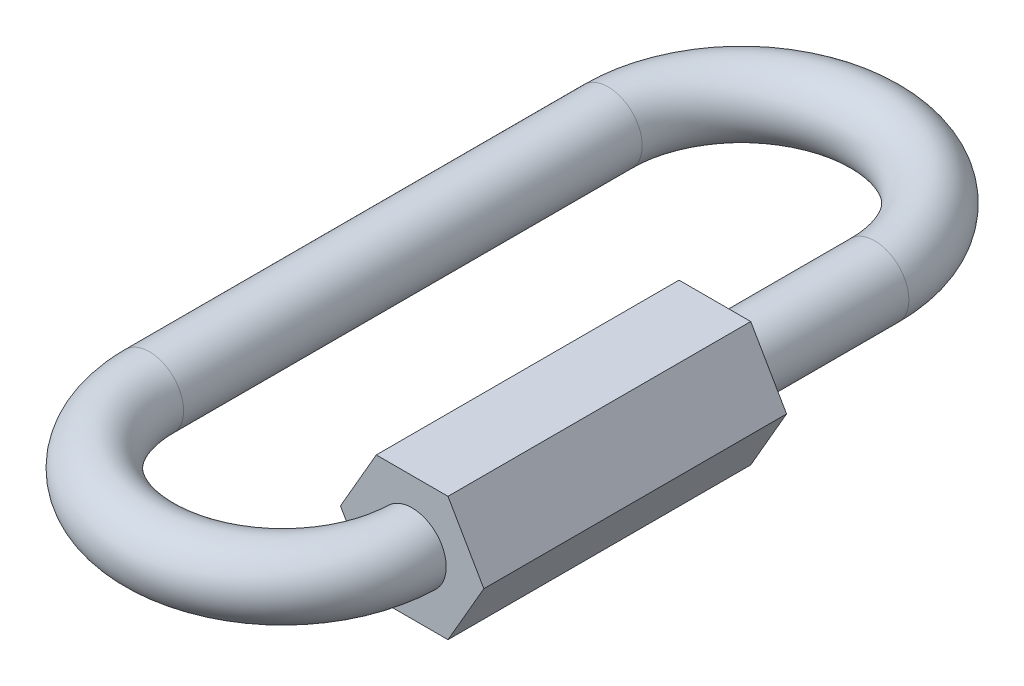
ISO-10303-21;
HEADER;
FILE_DESCRIPTION(('STEP AP214'),'2;1');
FILE_NAME('part.step','',(''),(''),'','','');
FILE_SCHEMA(('AUTOMOTIVE_DESIGN { 1 0 10303 214 1 1 1 1 }'));
ENDSEC;
DATA;
#1=APPLICATION_CONTEXT('core data for automotive mechanical design processes');
#2=APPLICATION_PROTOCOL_DEFINITION('international standard','automotive_design',2000,#1);
#3=PRODUCT_CONTEXT('',#1,'mechanical');
#4=PRODUCT('Part','Part','',(#3));
#5=PRODUCT_RELATED_PRODUCT_CATEGORY('part','',(#4));
#6=PRODUCT_DEFINITION_FORMATION('','',#4);
#7=PRODUCT_DEFINITION_CONTEXT('part definition',#1,'design');
#8=PRODUCT_DEFINITION('design','',#6,#7);
#9=PRODUCT_DEFINITION_SHAPE('','',#8);
#10=(LENGTH_UNIT() NAMED_UNIT(*) SI_UNIT(.MILLI.,.METRE.));
#11=(NAMED_UNIT(*) PLANE_ANGLE_UNIT() SI_UNIT($,.RADIAN.));
#12=(NAMED_UNIT(*) SI_UNIT($,.STERADIAN.) SOLID_ANGLE_UNIT());
#13=UNCERTAINTY_MEASURE_WITH_UNIT(LENGTH_MEASURE(1.E-05),#10,'distance_accuracy_value','');
#14=(GEOMETRIC_REPRESENTATION_CONTEXT(3) GLOBAL_UNCERTAINTY_ASSIGNED_CONTEXT((#13)) GLOBAL_UNIT_ASSIGNED_CONTEXT((#10,
#11,#12)) REPRESENTATION_CONTEXT('',''));
#15=CARTESIAN_POINT('',(0.,0.,0.));
#16=DIRECTION('',(0.,0.,1.));
#17=DIRECTION('',(1.,0.,0.));
#18=AXIS2_PLACEMENT_3D('',#15,#16,#17);
#19=CARTESIAN_POINT('',(8.5344,0.,-29.3624));
#20=DIRECTION('',(0.,0.,1.));
#21=DIRECTION('',(1.,0.,0.));
#22=AXIS2_PLACEMENT_3D('',#19,#20,#21);
#23=CYLINDRICAL_SURFACE('',#22,2.1844);
#24=CARTESIAN_POINT('',(8.5344,0.,-29.3624));
#25=DIRECTION('',(0.,0.,1.));
#26=DIRECTION('',(1.,0.,0.));
#27=AXIS2_PLACEMENT_3D('',#24,#25,#26);
#28=CIRCLE('',#27,2.1844);
#29=CARTESIAN_POINT('',(10.7188,0.,-29.3624));
#30=VERTEX_POINT('',#29);
#31=EDGE_CURVE('E48',#30,#30,#28,.T.);
#32=ORIENTED_EDGE('',*,*,#31,.T.);
#33=EDGE_LOOP('',(#32));
#34=FACE_BOUND('',#33,.T.);
#35=CARTESIAN_POINT('',(8.5344,0.,-19.1262));
#36=DIRECTION('',(0.,0.,1.));
#37=DIRECTION('',(1.,0.,0.));
#38=AXIS2_PLACEMENT_3D('',#35,#36,#37);
#39=CIRCLE('',#38,2.1844);
#40=CARTESIAN_POINT('',(10.7188,0.,-19.1262));
#41=VERTEX_POINT('',#40);
#42=EDGE_CURVE('E42',#41,#41,#39,.F.);
#43=ORIENTED_EDGE('',*,*,#42,.T.);
#44=EDGE_LOOP('',(#43));
#45=FACE_BOUND('',#44,.T.);
#46=ADVANCED_FACE('F39',(#34,#45),#23,.T.);
#47=CARTESIAN_POINT('',(0.,0.,-29.3624));
#48=DIRECTION('',(0.,-1.,0.));
#49=DIRECTION('',(0.,0.,-1.));
#50=AXIS2_PLACEMENT_3D('',#47,#48,#49);
#51=TOROIDAL_SURFACE('',#50,8.5344,2.1844);
#52=CARTESIAN_POINT('',(-8.5344,0.,-29.3624));
#53=DIRECTION('',(0.,0.,-1.));
#54=DIRECTION('',(-1.,0.,0.));
#55=AXIS2_PLACEMENT_3D('',#52,#53,#54);
#56=CIRCLE('',#55,2.1844);
#57=CARTESIAN_POINT('',(-10.7188,0.,-29.3624));
#58=VERTEX_POINT('',#57);
#59=EDGE_CURVE('E166',#58,#58,#56,.T.);
#60=CARTESIAN_POINT('',(0.,0.,-29.3624));
#61=DIRECTION('',(0.,-1.,0.));
#62=DIRECTION('',(0.,0.,-1.));
#63=AXIS2_PLACEMENT_3D('',#60,#61,#62);
#64=CIRCLE('',#63,10.7188);
#65=EDGE_CURVE('',#58,#30,#64,.T.);
#66=ORIENTED_EDGE('',*,*,#59,.T.);
#67=ORIENTED_EDGE('',*,*,#31,.F.);
#68=ORIENTED_EDGE('',*,*,#65,.T.);
#69=ORIENTED_EDGE('',*,*,#65,.F.);
#70=EDGE_LOOP('',(#66,#68,#67,#69));
#71=FACE_BOUND('',#70,.T.);
#72=ADVANCED_FACE('F212',(#71),#51,.T.);
#73=CARTESIAN_POINT('',(-8.5344,0.,0.));
#74=DIRECTION('',(0.,0.,-1.));
#75=DIRECTION('',(-1.,0.,0.));
#76=AXIS2_PLACEMENT_3D('',#73,#74,#75);
#77=CYLINDRICAL_SURFACE('',#76,2.1844);
#78=ORIENTED_EDGE('',*,*,#59,.F.);
#79=EDGE_LOOP('',(#78));
#80=FACE_BOUND('',#79,.T.);
#81=CARTESIAN_POINT('',(-8.5344,0.,0.));
#82=DIRECTION('',(0.,0.,-1.));
#83=DIRECTION('',(-1.,0.,0.));
#84=AXIS2_PLACEMENT_3D('',#81,#82,#83);
#85=CIRCLE('',#84,2.1844);
#86=CARTESIAN_POINT('',(-10.7188,0.,0.));
#87=VERTEX_POINT('',#86);
#88=EDGE_CURVE('E162',#87,#87,#85,.T.);
#89=ORIENTED_EDGE('',*,*,#88,.T.);
#90=EDGE_LOOP('',(#89));
#91=FACE_BOUND('',#90,.T.);
#92=ADVANCED_FACE('F209',(#80,#91),#77,.T.);
#93=CARTESIAN_POINT('',(0.,0.,0.));
#94=DIRECTION('',(0.,-1.,0.));
#95=DIRECTION('',(0.,0.,-1.));
#96=AXIS2_PLACEMENT_3D('',#93,#94,#95);
#97=TOROIDAL_SURFACE('',#96,8.5344,2.1844);
#98=CARTESIAN_POINT('',(6.60273635138359,-1.02913680307873,0.254));
#99=CARTESIAN_POINT('',(6.54493410424649,-0.920986220425956,0.254));
#100=CARTESIAN_POINT('',(6.49621928518624,-0.8078778166678,0.254));
#101=CARTESIAN_POINT('',(6.41843126140718,-0.574993585039513,0.254));
#102=CARTESIAN_POINT('',(6.38938161091199,-0.455209946933372,0.254));
#103=CARTESIAN_POINT('',(6.35182325519836,-0.212509207486216,0.254));
#104=CARTESIAN_POINT('',(6.34330512167944,-0.0895935706096579,0.254));
#105=CARTESIAN_POINT('',(6.34703425020259,0.155888940818484,0.254));
#106=CARTESIAN_POINT('',(6.35927637480292,0.27845589413898,0.254));
#107=CARTESIAN_POINT('',(6.4041615101203,0.519782205060274,0.254));
#108=CARTESIAN_POINT('',(6.43680230087442,0.638541975513966,0.254));
#109=CARTESIAN_POINT('',(6.52155357029986,0.868903204839223,0.254));
#110=CARTESIAN_POINT('',(6.57366483574345,0.980504374229056,0.254));
#111=CARTESIAN_POINT('',(6.69589141090897,1.19341508885029,0.254));
#112=CARTESIAN_POINT('',(6.76601235285301,1.29472140068128,0.254));
#113=CARTESIAN_POINT('',(6.92225564173177,1.48413430211098,0.254));
#114=CARTESIAN_POINT('',(7.00837801633404,1.57224086888596,0.254));
#115=CARTESIAN_POINT('',(7.19424426529594,1.73281866550042,0.254));
#116=CARTESIAN_POINT('',(7.29399761833261,1.80527892397456,0.254));
#117=CARTESIAN_POINT('',(7.50424786085047,1.93243478457657,0.254));
#118=CARTESIAN_POINT('',(7.6147447656595,1.98713036135907,0.254));
#119=CARTESIAN_POINT('',(7.84341217871587,2.07723356789663,0.254));
#120=CARTESIAN_POINT('',(7.96158690739055,2.11263048723407,0.254));
#121=CARTESIAN_POINT('',(8.20220145814708,2.16308572683327,0.254));
#122=CARTESIAN_POINT('',(8.32464129005774,2.17814400022198,0.254));
#123=CARTESIAN_POINT('',(8.57033083216974,2.18749381793182,0.254));
#124=CARTESIAN_POINT('',(8.69358066690469,2.18178209071412,0.254));
#125=CARTESIAN_POINT('',(8.93737129945404,2.14974403353757,0.254));
#126=CARTESIAN_POINT('',(9.05791209998716,2.12341772426786,0.254));
#127=CARTESIAN_POINT('',(9.29283934181651,2.05090139045678,0.254));
#128=CARTESIAN_POINT('',(9.40722688090245,2.00471492243439,0.254));
#129=CARTESIAN_POINT('',(9.62662054959956,1.89378714968666,0.254));
#130=CARTESIAN_POINT('',(9.7316266932342,1.82904587269795,0.254));
#131=CARTESIAN_POINT('',(9.92923875589832,1.6828695467608,0.254));
#132=CARTESIAN_POINT('',(10.0218488508389,1.60144014313072,0.254));
#133=CARTESIAN_POINT('',(10.1920779124684,1.42418441619786,0.254));
#134=CARTESIAN_POINT('',(10.2696969071704,1.3283581197984,0.254));
#135=CARTESIAN_POINT('',(10.4077126432411,1.12506423264063,0.254));
#136=CARTESIAN_POINT('',(10.4681152661837,1.01760063485084,0.254));
#137=CARTESIAN_POINT('',(10.5700163011543,0.794056086987122,0.254));
#138=CARTESIAN_POINT('',(10.6115147404582,0.677975149347002,0.254));
#139=CARTESIAN_POINT('',(10.6744192546228,0.440522789241047,0.254));
#140=CARTESIAN_POINT('',(10.695830416679,0.319152714426058,0.254));
#141=CARTESIAN_POINT('',(10.7179698336219,0.0745406394415559,0.254));
#142=CARTESIAN_POINT('',(10.7186981092979,-0.0487013588462882,0.254));
#143=CARTESIAN_POINT('',(10.699452250969,-0.293543165976258,0.254));
#144=CARTESIAN_POINT('',(10.679480601097,-0.415143170095078,0.254));
#145=CARTESIAN_POINT('',(10.6194064098322,-0.653264455420038,0.254));
#146=CARTESIAN_POINT('',(10.5793038631303,-0.769785735286791,0.254));
#147=CARTESIAN_POINT('',(10.4801061020859,-0.994446056659022,0.254));
#148=CARTESIAN_POINT('',(10.4210103234374,-1.10258484899477,0.254));
#149=CARTESIAN_POINT('',(10.2855056549608,-1.30740836187899,0.254));
#150=CARTESIAN_POINT('',(10.209096772541,-1.40409308732867,0.254));
#151=CARTESIAN_POINT('',(10.0411213576069,-1.5832827960198,0.254));
#152=CARTESIAN_POINT('',(9.94955217959093,-1.66578529930467,0.254));
#153=CARTESIAN_POINT('',(9.75386587675112,-1.81425166763972,0.254));
#154=CARTESIAN_POINT('',(9.64974871229466,-1.88021548045065,0.254));
#155=CARTESIAN_POINT('',(9.43188975199946,-1.99375300532673,0.254));
#156=CARTESIAN_POINT('',(9.31814513949982,-2.04132131267252,0.254));
#157=CARTESIAN_POINT('',(9.08428589560432,-2.11669433479014,0.254));
#158=CARTESIAN_POINT('',(8.96417123925851,-2.14449897214625,0.254));
#159=CARTESIAN_POINT('',(8.72093402386136,-2.17956586076819,0.254));
#160=CARTESIAN_POINT('',(8.59781035800673,-2.18682043481368,0.254));
#161=CARTESIAN_POINT('',(8.35209662039325,-2.1805620439935,0.254));
#162=CARTESIAN_POINT('',(8.22950652895662,-2.16704985160976,0.254));
#163=CARTESIAN_POINT('',(7.98830961754372,-2.11964053933295,0.254));
#164=CARTESIAN_POINT('',(7.86970357155274,-2.08573948237812,0.254));
#165=CARTESIAN_POINT('',(7.63983398464068,-1.99849638097936,0.254));
#166=CARTESIAN_POINT('',(7.52857228330814,-1.94514948746264,0.254));
#167=CARTESIAN_POINT('',(7.31653478488861,-1.82050750164412,0.254));
#168=CARTESIAN_POINT('',(7.21576473308129,-1.7492026477803,0.254));
#169=CARTESIAN_POINT('',(7.02772753360835,-1.59072855479036,0.254));
#170=CARTESIAN_POINT('',(6.94044427950081,-1.50357851373016,0.254));
#171=CARTESIAN_POINT('',(6.81152570499766,-1.35111572896811,0.254));
#172=CARTESIAN_POINT('',(6.76503286784255,-1.28983922058868,0.254));
#173=CARTESIAN_POINT('',(6.67874926482742,-1.1627363853237,0.254));
#174=CARTESIAN_POINT('',(6.63895849957426,-1.09691005802617,0.254));
#175=CARTESIAN_POINT('',(6.60273635138359,-1.02913680307873,0.254));
#176=B_SPLINE_CURVE_WITH_KNOTS('',3,(#98,#99,#100,#101,#102,#103,#104,#105,#106,#107,#108,#109,
#110,#111,#112,#113,#114,#115,#116,#117,#118,#119,#120,#121,#122,#123,#124,#125,#126,#127,#128,
#129,#130,#131,#132,#133,#134,#135,#136,#137,#138,#139,#140,#141,#142,#143,#144,#145,#146,#147,
#148,#149,#150,#151,#152,#153,#154,#155,#156,#157,#158,#159,#160,#161,#162,#163,#164,#165,#166,
#167,#168,#169,#170,#171,#172,#173,#174,#175),.UNSPECIFIED.,.T.,.F.,(4,2,2,2,2,2,2,2,2,2,2,2,2,
2,2,2,2,2,2,2,2,2,2,2,2,2,2,2,2,2,2,2,2,2,2,2,2,2,4),(0.,0.367603965082595,0.735647457441261,
1.1035219079167,1.47130533554641,1.83904874470531,2.20680701542351,2.57468043666647,
2.94255449399294,3.31068567698003,3.67881738518784,4.04715319262772,4.41548984894398,
4.78388452547374,5.15227883227705,5.52060719519399,5.88893500751859,6.25713842567372,
6.62534115577977,6.99341794678795,7.36149420671508,7.72947722444954,8.09745987230981,
8.46539836484343,8.83333695441116,9.20128647677521,9.56923584169236,9.93724948230987,
10.3052642853233,10.6733871314848,11.0415114196023,11.4097732157531,11.7780213136375,
12.146340542565,12.5147516795936,12.883363510886,13.2515316718795,13.4818930289636,
13.7122544069066),.UNSPECIFIED.);
#177=CARTESIAN_POINT('',(6.60273635138359,-1.02913680307873,0.254));
#178=VERTEX_POINT('',#177);
#179=EDGE_CURVE('E11',#178,#178,#176,.T.);
#180=ORIENTED_EDGE('',*,*,#179,.F.);
#181=EDGE_LOOP('',(#180));
#182=FACE_BOUND('',#181,.T.);
#183=ORIENTED_EDGE('',*,*,#88,.F.);
#184=EDGE_LOOP('',(#183));
#185=FACE_BOUND('',#184,.T.);
#186=ADVANCED_FACE('F177',(#182,#185),#97,.T.);
#187=CARTESIAN_POINT('',(10.8294250550557,-3.9751,-19.1262));
#188=DIRECTION('',(0.866025403784439,-0.5,0.));
#189=DIRECTION('',(0.5,0.866025403784439,0.));
#190=AXIS2_PLACEMENT_3D('',#187,#188,#189);
#191=PLANE('',#190);
#192=DIRECTION('',(0.,0.,1.));
#193=VECTOR('',#192,1.);
#194=CARTESIAN_POINT('',(13.1244501101114,0.,-19.1262));
#195=LINE('',#194,#193);
#196=CARTESIAN_POINT('',(13.1244501101114,0.,-19.1262));
#197=VERTEX_POINT('',#196);
#198=CARTESIAN_POINT('',(13.1244501101114,0.,0.254));
#199=VERTEX_POINT('',#198);
#200=EDGE_CURVE('E92',#197,#199,#195,.T.);
#201=ORIENTED_EDGE('',*,*,#200,.T.);
#202=DIRECTION('',(0.5,0.866025403784439,0.));
#203=VECTOR('',#202,1.);
#204=CARTESIAN_POINT('',(10.8294250550557,-3.9751,0.254));
#205=LINE('',#204,#203);
#206=CARTESIAN_POINT('',(10.8294250550557,-3.9751,0.254));
#207=VERTEX_POINT('',#206);
#208=EDGE_CURVE('E96',#207,#199,#205,.T.);
#209=ORIENTED_EDGE('',*,*,#208,.F.);
#210=DIRECTION('',(0.,0.,1.));
#211=VECTOR('',#210,1.);
#212=CARTESIAN_POINT('',(10.8294250550557,-3.9751,-19.1262));
#213=LINE('',#212,#211);
#214=CARTESIAN_POINT('',(10.8294250550557,-3.9751,-19.1262));
#215=VERTEX_POINT('',#214);
#216=EDGE_CURVE('E55',#215,#207,#213,.T.);
#217=ORIENTED_EDGE('',*,*,#216,.F.);
#218=DIRECTION('',(0.5,0.866025403784439,0.));
#219=VECTOR('',#218,1.);
#220=CARTESIAN_POINT('',(10.8294250550557,-3.9751,-19.1262));
#221=LINE('',#220,#219);
#222=EDGE_CURVE('E97',#215,#197,#221,.T.);
#223=ORIENTED_EDGE('',*,*,#222,.T.);
#224=EDGE_LOOP('',(#201,#209,#217,#223));
#225=FACE_BOUND('',#224,.T.);
#226=ADVANCED_FACE('F94',(#225),#191,.T.);
#227=CARTESIAN_POINT('',(6.23937494494432,-3.9751,-19.1262));
#228=DIRECTION('',(0.,-1.,0.));
#229=DIRECTION('',(0.,0.,-1.));
#230=AXIS2_PLACEMENT_3D('',#227,#228,#229);
#231=PLANE('',#230);
#232=ORIENTED_EDGE('',*,*,#216,.T.);
#233=DIRECTION('',(1.,0.,0.));
#234=VECTOR('',#233,1.);
#235=CARTESIAN_POINT('',(6.23937494494432,-3.9751,0.254));
#236=LINE('',#235,#234);
#237=CARTESIAN_POINT('',(6.23937494494432,-3.9751,0.254));
#238=VERTEX_POINT('',#237);
#239=EDGE_CURVE('E117',#238,#207,#236,.T.);
#240=ORIENTED_EDGE('',*,*,#239,.F.);
#241=DIRECTION('',(0.,0.,1.));
#242=VECTOR('',#241,1.);
#243=CARTESIAN_POINT('',(6.23937494494432,-3.9751,-19.1262));
#244=LINE('',#243,#242);
#245=CARTESIAN_POINT('',(6.23937494494432,-3.9751,-19.1262));
#246=VERTEX_POINT('',#245);
#247=EDGE_CURVE('E63',#246,#238,#244,.T.);
#248=ORIENTED_EDGE('',*,*,#247,.F.);
#249=DIRECTION('',(1.,0.,0.));
#250=VECTOR('',#249,1.);
#251=CARTESIAN_POINT('',(6.23937494494432,-3.9751,-19.1262));
#252=LINE('',#251,#250);
#253=EDGE_CURVE('E103',#246,#215,#252,.T.);
#254=ORIENTED_EDGE('',*,*,#253,.T.);
#255=EDGE_LOOP('',(#232,#240,#248,#254));
#256=FACE_BOUND('',#255,.T.);
#257=ADVANCED_FACE('F189',(#256),#231,.T.);
#258=CARTESIAN_POINT('',(3.94434988988864,0.,-19.1262));
#259=DIRECTION('',(-0.866025403784439,-0.499999999999999,0.));
#260=DIRECTION('',(0.5,-0.866025403784439,0.));
#261=AXIS2_PLACEMENT_3D('',#258,#259,#260);
#262=PLANE('',#261);
#263=ORIENTED_EDGE('',*,*,#247,.T.);
#264=DIRECTION('',(0.5,-0.866025403784439,0.));
#265=VECTOR('',#264,1.);
#266=CARTESIAN_POINT('',(3.94434988988864,0.,0.254));
#267=LINE('',#266,#265);
#268=CARTESIAN_POINT('',(3.94434988988864,0.,0.254));
#269=VERTEX_POINT('',#268);
#270=EDGE_CURVE('E127',#269,#238,#267,.T.);
#271=ORIENTED_EDGE('',*,*,#270,.F.);
#272=DIRECTION('',(0.,0.,1.));
#273=VECTOR('',#272,1.);
#274=CARTESIAN_POINT('',(3.94434988988864,0.,-19.1262));
#275=LINE('',#274,#273);
#276=CARTESIAN_POINT('',(3.94434988988864,0.,-19.1262));
#277=VERTEX_POINT('',#276);
#278=EDGE_CURVE('E154',#277,#269,#275,.T.);
#279=ORIENTED_EDGE('',*,*,#278,.F.);
#280=DIRECTION('',(0.5,-0.866025403784439,0.));
#281=VECTOR('',#280,1.);
#282=CARTESIAN_POINT('',(3.94434988988864,0.,-19.1262));
#283=LINE('',#282,#281);
#284=EDGE_CURVE('E145',#277,#246,#283,.T.);
#285=ORIENTED_EDGE('',*,*,#284,.T.);
#286=EDGE_LOOP('',(#263,#271,#279,#285));
#287=FACE_BOUND('',#286,.T.);
#288=ADVANCED_FACE('F192',(#287),#262,.T.);
#289=CARTESIAN_POINT('',(6.23937494494432,3.9751,-19.1262));
#290=DIRECTION('',(-0.866025403784439,0.5,0.));
#291=DIRECTION('',(-0.5,-0.866025403784439,0.));
#292=AXIS2_PLACEMENT_3D('',#289,#290,#291);
#293=PLANE('',#292);
#294=ORIENTED_EDGE('',*,*,#278,.T.);
#295=DIRECTION('',(-0.5,-0.866025403784439,0.));
#296=VECTOR('',#295,1.);
#297=CARTESIAN_POINT('',(6.23937494494432,3.9751,0.254));
#298=LINE('',#297,#296);
#299=CARTESIAN_POINT('',(6.23937494494432,3.9751,0.254));
#300=VERTEX_POINT('',#299);
#301=EDGE_CURVE('E123',#300,#269,#298,.T.);
#302=ORIENTED_EDGE('',*,*,#301,.F.);
#303=DIRECTION('',(0.,0.,1.));
#304=VECTOR('',#303,1.);
#305=CARTESIAN_POINT('',(6.23937494494432,3.9751,-19.1262));
#306=LINE('',#305,#304);
#307=CARTESIAN_POINT('',(6.23937494494432,3.9751,-19.1262));
#308=VERTEX_POINT('',#307);
#309=EDGE_CURVE('E157',#308,#300,#306,.T.);
#310=ORIENTED_EDGE('',*,*,#309,.F.);
#311=DIRECTION('',(-0.5,-0.866025403784439,0.));
#312=VECTOR('',#311,1.);
#313=CARTESIAN_POINT('',(6.23937494494432,3.9751,-19.1262));
#314=LINE('',#313,#312);
#315=EDGE_CURVE('E141',#308,#277,#314,.T.);
#316=ORIENTED_EDGE('',*,*,#315,.T.);
#317=EDGE_LOOP('',(#294,#302,#310,#316));
#318=FACE_BOUND('',#317,.T.);
#319=ADVANCED_FACE('F195',(#318),#293,.T.);
#320=CARTESIAN_POINT('',(10.8294250550557,3.9751,-19.1262));
#321=DIRECTION('',(0.,1.,0.));
#322=DIRECTION('',(0.,0.,1.));
#323=AXIS2_PLACEMENT_3D('',#320,#321,#322);
#324=PLANE('',#323);
#325=ORIENTED_EDGE('',*,*,#309,.T.);
#326=DIRECTION('',(-1.,0.,0.));
#327=VECTOR('',#326,1.);
#328=CARTESIAN_POINT('',(10.8294250550557,3.9751,0.254));
#329=LINE('',#328,#327);
#330=CARTESIAN_POINT('',(10.8294250550557,3.9751,0.254));
#331=VERTEX_POINT('',#330);
#332=EDGE_CURVE('E112',#331,#300,#329,.T.);
#333=ORIENTED_EDGE('',*,*,#332,.F.);
#334=DIRECTION('',(0.,0.,1.));
#335=VECTOR('',#334,1.);
#336=CARTESIAN_POINT('',(10.8294250550557,3.9751,-19.1262));
#337=LINE('',#336,#335);
#338=CARTESIAN_POINT('',(10.8294250550557,3.9751,-19.1262));
#339=VERTEX_POINT('',#338);
#340=EDGE_CURVE('E102',#339,#331,#337,.T.);
#341=ORIENTED_EDGE('',*,*,#340,.F.);
#342=DIRECTION('',(-1.,0.,0.));
#343=VECTOR('',#342,1.);
#344=CARTESIAN_POINT('',(10.8294250550557,3.9751,-19.1262));
#345=LINE('',#344,#343);
#346=EDGE_CURVE('E137',#339,#308,#345,.T.);
#347=ORIENTED_EDGE('',*,*,#346,.T.);
#348=EDGE_LOOP('',(#325,#333,#341,#347));
#349=FACE_BOUND('',#348,.T.);
#350=ADVANCED_FACE('F199',(#349),#324,.T.);
#351=CARTESIAN_POINT('',(13.1244501101114,0.,-19.1262));
#352=DIRECTION('',(0.866025403784439,0.5,0.));
#353=DIRECTION('',(-0.5,0.866025403784439,0.));
#354=AXIS2_PLACEMENT_3D('',#351,#352,#353);
#355=PLANE('',#354);
#356=ORIENTED_EDGE('',*,*,#340,.T.);
#357=DIRECTION('',(-0.5,0.866025403784439,0.));
#358=VECTOR('',#357,1.);
#359=CARTESIAN_POINT('',(13.1244501101114,0.,0.254));
#360=LINE('',#359,#358);
#361=EDGE_CURVE('E106',#199,#331,#360,.T.);
#362=ORIENTED_EDGE('',*,*,#361,.F.);
#363=ORIENTED_EDGE('',*,*,#200,.F.);
#364=DIRECTION('',(-0.5,0.866025403784439,0.));
#365=VECTOR('',#364,1.);
#366=CARTESIAN_POINT('',(13.1244501101114,0.,-19.1262));
#367=LINE('',#366,#365);
#368=EDGE_CURVE('E134',#197,#339,#367,.T.);
#369=ORIENTED_EDGE('',*,*,#368,.T.);
#370=EDGE_LOOP('',(#356,#362,#363,#369));
#371=FACE_BOUND('',#370,.T.);
#372=ADVANCED_FACE('F107',(#371),#355,.T.);
#373=CARTESIAN_POINT('',(0.,0.,-19.1262));
#374=DIRECTION('',(0.,0.,1.));
#375=DIRECTION('',(1.,0.,0.));
#376=AXIS2_PLACEMENT_3D('',#373,#374,#375);
#377=PLANE('',#376);
#378=ORIENTED_EDGE('',*,*,#42,.F.);
#379=EDGE_LOOP('',(#378));
#380=FACE_BOUND('',#379,.T.);
#381=ORIENTED_EDGE('',*,*,#222,.F.);
#382=ORIENTED_EDGE('',*,*,#253,.F.);
#383=ORIENTED_EDGE('',*,*,#284,.F.);
#384=ORIENTED_EDGE('',*,*,#315,.F.);
#385=ORIENTED_EDGE('',*,*,#346,.F.);
#386=ORIENTED_EDGE('',*,*,#368,.F.);
#387=EDGE_LOOP('',(#381,#382,#383,#384,#385,#386));
#388=FACE_BOUND('',#387,.T.);
#389=ADVANCED_FACE('F184',(#380,#388),#377,.F.);
#390=CARTESIAN_POINT('',(0.,0.,0.254));
#391=DIRECTION('',(0.,0.,1.));
#392=DIRECTION('',(1.,0.,0.));
#393=AXIS2_PLACEMENT_3D('',#390,#391,#392);
#394=PLANE('',#393);
#395=ORIENTED_EDGE('',*,*,#179,.T.);
#396=EDGE_LOOP('',(#395));
#397=FACE_BOUND('',#396,.T.);
#398=ORIENTED_EDGE('',*,*,#208,.T.);
#399=ORIENTED_EDGE('',*,*,#361,.T.);
#400=ORIENTED_EDGE('',*,*,#332,.T.);
#401=ORIENTED_EDGE('',*,*,#301,.T.);
#402=ORIENTED_EDGE('',*,*,#270,.T.);
#403=ORIENTED_EDGE('',*,*,#239,.T.);
#404=EDGE_LOOP('',(#398,#399,#400,#401,#402,#403));
#405=FACE_BOUND('',#404,.T.);
#406=ADVANCED_FACE('F115',(#397,#405),#394,.T.);
#407=CLOSED_SHELL('',(#46,#72,#92,#186,#226,#257,#288,#319,#350,#372,#389,#406));
#408=MANIFOLD_SOLID_BREP('B2',#407);
#409=ADVANCED_BREP_SHAPE_REPRESENTATION('',(#18,#408),#14);
#410=SHAPE_DEFINITION_REPRESENTATION(#9,#409);
ENDSEC;
END-ISO-10303-21;
